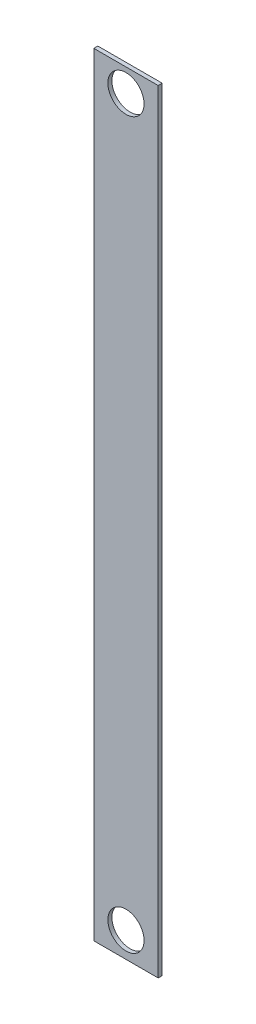
ISO-10303-21;
HEADER;
FILE_DESCRIPTION(('STEP AP214'),'2;1');
FILE_NAME('part.step','',(''),(''),'','','');
FILE_SCHEMA(('AUTOMOTIVE_DESIGN { 1 0 10303 214 1 1 1 1 }'));
ENDSEC;
DATA;
#1=APPLICATION_CONTEXT('core data for automotive mechanical design processes');
#2=APPLICATION_PROTOCOL_DEFINITION('international standard','automotive_design',2000,#1);
#3=PRODUCT_CONTEXT('',#1,'mechanical');
#4=PRODUCT('Part','Part','',(#3));
#5=PRODUCT_RELATED_PRODUCT_CATEGORY('part','',(#4));
#6=PRODUCT_DEFINITION_FORMATION('','',#4);
#7=PRODUCT_DEFINITION_CONTEXT('part definition',#1,'design');
#8=PRODUCT_DEFINITION('design','',#6,#7);
#9=PRODUCT_DEFINITION_SHAPE('','',#8);
#10=(LENGTH_UNIT() NAMED_UNIT(*) SI_UNIT(.MILLI.,.METRE.));
#11=(NAMED_UNIT(*) PLANE_ANGLE_UNIT() SI_UNIT($,.RADIAN.));
#12=(NAMED_UNIT(*) SI_UNIT($,.STERADIAN.) SOLID_ANGLE_UNIT());
#13=UNCERTAINTY_MEASURE_WITH_UNIT(LENGTH_MEASURE(1.E-05),#10,'distance_accuracy_value','');
#14=(GEOMETRIC_REPRESENTATION_CONTEXT(3) GLOBAL_UNCERTAINTY_ASSIGNED_CONTEXT((#13)) GLOBAL_UNIT_ASSIGNED_CONTEXT((#10,
#11,#12)) REPRESENTATION_CONTEXT('',''));
#15=CARTESIAN_POINT('',(0.,0.,0.));
#16=DIRECTION('',(0.,0.,1.));
#17=DIRECTION('',(1.,0.,0.));
#18=AXIS2_PLACEMENT_3D('',#15,#16,#17);
#19=CARTESIAN_POINT('',(0.,0.,3.175));
#20=DIRECTION('',(1.,0.,0.));
#21=DIRECTION('',(0.,1.,0.));
#22=AXIS2_PLACEMENT_3D('',#19,#20,#21);
#23=PLANE('',#22);
#24=DIRECTION('',(0.,-1.,0.));
#25=VECTOR('',#24,1.);
#26=CARTESIAN_POINT('',(0.,0.,0.));
#27=LINE('',#26,#25);
#28=CARTESIAN_POINT('',(0.,0.,0.));
#29=VERTEX_POINT('',#28);
#30=CARTESIAN_POINT('',(0.,-609.6,0.));
#31=VERTEX_POINT('',#30);
#32=EDGE_CURVE('E105',#29,#31,#27,.T.);
#33=ORIENTED_EDGE('',*,*,#32,.T.);
#34=DIRECTION('',(0.,0.,-1.));
#35=VECTOR('',#34,1.);
#36=CARTESIAN_POINT('',(0.,-609.6,3.175));
#37=LINE('',#36,#35);
#38=CARTESIAN_POINT('',(0.,-609.6,3.175));
#39=VERTEX_POINT('',#38);
#40=EDGE_CURVE('E11',#39,#31,#37,.T.);
#41=ORIENTED_EDGE('',*,*,#40,.F.);
#42=DIRECTION('',(0.,-1.,0.));
#43=VECTOR('',#42,1.);
#44=CARTESIAN_POINT('',(0.,0.,3.175));
#45=LINE('',#44,#43);
#46=CARTESIAN_POINT('',(0.,0.,3.175));
#47=VERTEX_POINT('',#46);
#48=EDGE_CURVE('E89',#47,#39,#45,.T.);
#49=ORIENTED_EDGE('',*,*,#48,.F.);
#50=DIRECTION('',(0.,0.,-1.));
#51=VECTOR('',#50,1.);
#52=CARTESIAN_POINT('',(0.,0.,3.175));
#53=LINE('',#52,#51);
#54=EDGE_CURVE('E98',#47,#29,#53,.T.);
#55=ORIENTED_EDGE('',*,*,#54,.T.);
#56=EDGE_LOOP('',(#33,#41,#49,#55));
#57=FACE_BOUND('',#56,.T.);
#58=ADVANCED_FACE('F39',(#57),#23,.F.);
#59=CARTESIAN_POINT('',(0.,-609.6,3.175));
#60=DIRECTION('',(0.,1.,0.));
#61=DIRECTION('',(0.,0.,1.));
#62=AXIS2_PLACEMENT_3D('',#59,#60,#61);
#63=PLANE('',#62);
#64=DIRECTION('',(1.,0.,0.));
#65=VECTOR('',#64,1.);
#66=CARTESIAN_POINT('',(0.,-609.6,0.));
#67=LINE('',#66,#65);
#68=CARTESIAN_POINT('',(50.8000000000001,-609.6,0.));
#69=VERTEX_POINT('',#68);
#70=EDGE_CURVE('E94',#31,#69,#67,.T.);
#71=ORIENTED_EDGE('',*,*,#70,.T.);
#72=DIRECTION('',(0.,0.,-1.));
#73=VECTOR('',#72,1.);
#74=CARTESIAN_POINT('',(50.8000000000001,-609.6,3.175));
#75=LINE('',#74,#73);
#76=CARTESIAN_POINT('',(50.8000000000001,-609.6,3.175));
#77=VERTEX_POINT('',#76);
#78=EDGE_CURVE('E50',#77,#69,#75,.T.);
#79=ORIENTED_EDGE('',*,*,#78,.F.);
#80=DIRECTION('',(1.,0.,0.));
#81=VECTOR('',#80,1.);
#82=CARTESIAN_POINT('',(0.,-609.6,3.175));
#83=LINE('',#82,#81);
#84=EDGE_CURVE('E81',#39,#77,#83,.T.);
#85=ORIENTED_EDGE('',*,*,#84,.F.);
#86=ORIENTED_EDGE('',*,*,#40,.T.);
#87=EDGE_LOOP('',(#71,#79,#85,#86));
#88=FACE_BOUND('',#87,.T.);
#89=ADVANCED_FACE('F91',(#88),#63,.F.);
#90=CARTESIAN_POINT('',(50.8,0.,3.175));
#91=DIRECTION('',(-1.,0.,0.));
#92=DIRECTION('',(0.,-1.,0.));
#93=AXIS2_PLACEMENT_3D('',#90,#91,#92);
#94=PLANE('',#93);
#95=DIRECTION('',(0.,1.,0.));
#96=VECTOR('',#95,1.);
#97=CARTESIAN_POINT('',(50.8,0.,0.));
#98=LINE('',#97,#96);
#99=CARTESIAN_POINT('',(50.8,0.,0.));
#100=VERTEX_POINT('',#99);
#101=EDGE_CURVE('E75',#69,#100,#98,.T.);
#102=ORIENTED_EDGE('',*,*,#101,.T.);
#103=DIRECTION('',(0.,0.,-1.));
#104=VECTOR('',#103,1.);
#105=CARTESIAN_POINT('',(50.8,0.,3.175));
#106=LINE('',#105,#104);
#107=CARTESIAN_POINT('',(50.8,0.,3.175));
#108=VERTEX_POINT('',#107);
#109=EDGE_CURVE('E92',#108,#100,#106,.T.);
#110=ORIENTED_EDGE('',*,*,#109,.F.);
#111=DIRECTION('',(0.,1.,0.));
#112=VECTOR('',#111,1.);
#113=CARTESIAN_POINT('',(50.8,0.,3.175));
#114=LINE('',#113,#112);
#115=EDGE_CURVE('E86',#77,#108,#114,.T.);
#116=ORIENTED_EDGE('',*,*,#115,.F.);
#117=ORIENTED_EDGE('',*,*,#78,.T.);
#118=EDGE_LOOP('',(#102,#110,#116,#117));
#119=FACE_BOUND('',#118,.T.);
#120=ADVANCED_FACE('F96',(#119),#94,.F.);
#121=CARTESIAN_POINT('',(0.,0.,3.175));
#122=DIRECTION('',(0.,-1.,0.));
#123=DIRECTION('',(0.,0.,-1.));
#124=AXIS2_PLACEMENT_3D('',#121,#122,#123);
#125=PLANE('',#124);
#126=DIRECTION('',(-1.,0.,0.));
#127=VECTOR('',#126,1.);
#128=CARTESIAN_POINT('',(0.,0.,0.));
#129=LINE('',#128,#127);
#130=EDGE_CURVE('E77',#100,#29,#129,.T.);
#131=ORIENTED_EDGE('',*,*,#130,.T.);
#132=ORIENTED_EDGE('',*,*,#54,.F.);
#133=DIRECTION('',(-1.,0.,0.));
#134=VECTOR('',#133,1.);
#135=CARTESIAN_POINT('',(0.,0.,3.175));
#136=LINE('',#135,#134);
#137=EDGE_CURVE('E54',#108,#47,#136,.T.);
#138=ORIENTED_EDGE('',*,*,#137,.F.);
#139=ORIENTED_EDGE('',*,*,#109,.T.);
#140=EDGE_LOOP('',(#131,#132,#138,#139));
#141=FACE_BOUND('',#140,.T.);
#142=ADVANCED_FACE('F109',(#141),#125,.F.);
#143=CARTESIAN_POINT('',(0.,0.,3.175));
#144=DIRECTION('',(0.,0.,1.));
#145=DIRECTION('',(1.,0.,0.));
#146=AXIS2_PLACEMENT_3D('',#143,#144,#145);
#147=PLANE('',#146);
#148=CARTESIAN_POINT('',(25.4,-18.1413640627852,3.175));
#149=DIRECTION('',(0.,0.,1.));
#150=DIRECTION('',(1.,0.,0.));
#151=AXIS2_PLACEMENT_3D('',#148,#149,#150);
#152=CIRCLE('',#151,14.279);
#153=CARTESIAN_POINT('',(39.679,-18.1413640627852,3.175));
#154=VERTEX_POINT('',#153);
#155=EDGE_CURVE('E124',#154,#154,#152,.T.);
#156=ORIENTED_EDGE('',*,*,#155,.F.);
#157=EDGE_LOOP('',(#156));
#158=FACE_BOUND('',#157,.T.);
#159=CARTESIAN_POINT('',(25.4000000000001,-589.6,3.175));
#160=DIRECTION('',(0.,0.,1.));
#161=DIRECTION('',(1.,0.,0.));
#162=AXIS2_PLACEMENT_3D('',#159,#160,#161);
#163=CIRCLE('',#162,14.279);
#164=CARTESIAN_POINT('',(39.6790000000001,-589.6,3.175));
#165=VERTEX_POINT('',#164);
#166=EDGE_CURVE('E120',#165,#165,#163,.T.);
#167=ORIENTED_EDGE('',*,*,#166,.F.);
#168=EDGE_LOOP('',(#167));
#169=FACE_BOUND('',#168,.T.);
#170=ORIENTED_EDGE('',*,*,#48,.T.);
#171=ORIENTED_EDGE('',*,*,#84,.T.);
#172=ORIENTED_EDGE('',*,*,#115,.T.);
#173=ORIENTED_EDGE('',*,*,#137,.T.);
#174=EDGE_LOOP('',(#170,#171,#172,#173));
#175=FACE_BOUND('',#174,.T.);
#176=ADVANCED_FACE('F88',(#158,#169,#175),#147,.T.);
#177=CARTESIAN_POINT('',(0.,0.,0.));
#178=DIRECTION('',(0.,0.,1.));
#179=DIRECTION('',(1.,0.,0.));
#180=AXIS2_PLACEMENT_3D('',#177,#178,#179);
#181=PLANE('',#180);
#182=CARTESIAN_POINT('',(25.4,-18.1413640627852,0.));
#183=DIRECTION('',(0.,0.,1.));
#184=DIRECTION('',(1.,0.,0.));
#185=AXIS2_PLACEMENT_3D('',#182,#183,#184);
#186=CIRCLE('',#185,14.279);
#187=CARTESIAN_POINT('',(39.679,-18.1413640627852,0.));
#188=VERTEX_POINT('',#187);
#189=EDGE_CURVE('E104',#188,#188,#186,.T.);
#190=ORIENTED_EDGE('',*,*,#189,.T.);
#191=EDGE_LOOP('',(#190));
#192=FACE_BOUND('',#191,.T.);
#193=CARTESIAN_POINT('',(25.4000000000001,-589.6,0.));
#194=DIRECTION('',(0.,0.,1.));
#195=DIRECTION('',(1.,0.,0.));
#196=AXIS2_PLACEMENT_3D('',#193,#194,#195);
#197=CIRCLE('',#196,14.279);
#198=CARTESIAN_POINT('',(39.6790000000001,-589.6,0.));
#199=VERTEX_POINT('',#198);
#200=EDGE_CURVE('E118',#199,#199,#197,.T.);
#201=ORIENTED_EDGE('',*,*,#200,.T.);
#202=EDGE_LOOP('',(#201));
#203=FACE_BOUND('',#202,.T.);
#204=ORIENTED_EDGE('',*,*,#32,.F.);
#205=ORIENTED_EDGE('',*,*,#130,.F.);
#206=ORIENTED_EDGE('',*,*,#101,.F.);
#207=ORIENTED_EDGE('',*,*,#70,.F.);
#208=EDGE_LOOP('',(#204,#205,#206,#207));
#209=FACE_BOUND('',#208,.T.);
#210=ADVANCED_FACE('F114',(#192,#203,#209),#181,.F.);
#211=CARTESIAN_POINT('',(25.4000000000001,-589.6,0.));
#212=DIRECTION('',(0.,0.,1.));
#213=DIRECTION('',(1.,0.,0.));
#214=AXIS2_PLACEMENT_3D('',#211,#212,#213);
#215=CYLINDRICAL_SURFACE('',#214,14.279);
#216=ORIENTED_EDGE('',*,*,#200,.F.);
#217=EDGE_LOOP('',(#216));
#218=FACE_BOUND('',#217,.T.);
#219=ORIENTED_EDGE('',*,*,#166,.T.);
#220=EDGE_LOOP('',(#219));
#221=FACE_BOUND('',#220,.T.);
#222=ADVANCED_FACE('F132',(#218,#221),#215,.F.);
#223=CARTESIAN_POINT('',(25.4,-18.1413640627852,0.));
#224=DIRECTION('',(0.,0.,1.));
#225=DIRECTION('',(1.,0.,0.));
#226=AXIS2_PLACEMENT_3D('',#223,#224,#225);
#227=CYLINDRICAL_SURFACE('',#226,14.279);
#228=ORIENTED_EDGE('',*,*,#189,.F.);
#229=EDGE_LOOP('',(#228));
#230=FACE_BOUND('',#229,.T.);
#231=ORIENTED_EDGE('',*,*,#155,.T.);
#232=EDGE_LOOP('',(#231));
#233=FACE_BOUND('',#232,.T.);
#234=ADVANCED_FACE('F128',(#230,#233),#227,.F.);
#235=CLOSED_SHELL('',(#58,#89,#120,#142,#176,#210,#222,#234));
#236=MANIFOLD_SOLID_BREP('B2',#235);
#237=ADVANCED_BREP_SHAPE_REPRESENTATION('',(#18,#236),#14);
#238=SHAPE_DEFINITION_REPRESENTATION(#9,#237);
ENDSEC;
END-ISO-10303-21;
